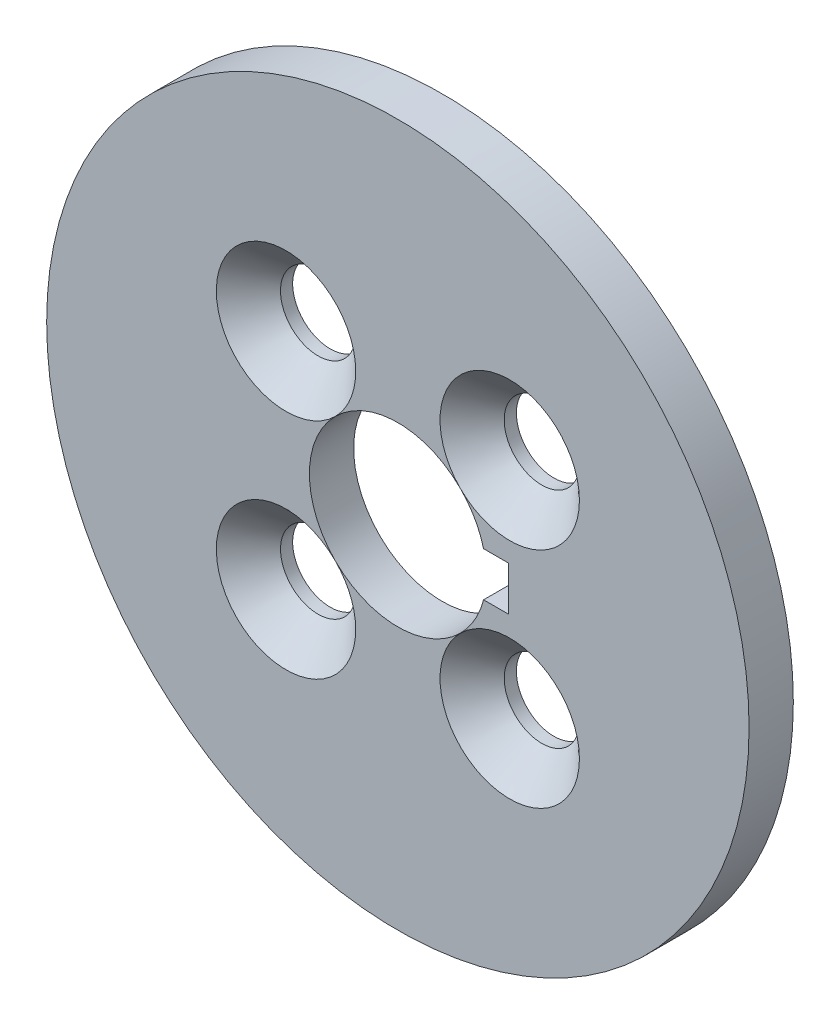
ISO-10303-21;
HEADER;
FILE_DESCRIPTION(('STEP AP214'),'2;1');
FILE_NAME('part.step','',(''),(''),'','','');
FILE_SCHEMA(('AUTOMOTIVE_DESIGN { 1 0 10303 214 1 1 1 1 }'));
ENDSEC;
DATA;
#1=APPLICATION_CONTEXT('core data for automotive mechanical design processes');
#2=APPLICATION_PROTOCOL_DEFINITION('international standard','automotive_design',2000,#1);
#3=PRODUCT_CONTEXT('',#1,'mechanical');
#4=PRODUCT('Part','Part','',(#3));
#5=PRODUCT_RELATED_PRODUCT_CATEGORY('part','',(#4));
#6=PRODUCT_DEFINITION_FORMATION('','',#4);
#7=PRODUCT_DEFINITION_CONTEXT('part definition',#1,'design');
#8=PRODUCT_DEFINITION('design','',#6,#7);
#9=PRODUCT_DEFINITION_SHAPE('','',#8);
#10=(LENGTH_UNIT() NAMED_UNIT(*) SI_UNIT(.MILLI.,.METRE.));
#11=(NAMED_UNIT(*) PLANE_ANGLE_UNIT() SI_UNIT($,.RADIAN.));
#12=(NAMED_UNIT(*) SI_UNIT($,.STERADIAN.) SOLID_ANGLE_UNIT());
#13=UNCERTAINTY_MEASURE_WITH_UNIT(LENGTH_MEASURE(1.E-05),#10,'distance_accuracy_value','');
#14=(GEOMETRIC_REPRESENTATION_CONTEXT(3) GLOBAL_UNCERTAINTY_ASSIGNED_CONTEXT((#13)) GLOBAL_UNIT_ASSIGNED_CONTEXT((#10,
#11,#12)) REPRESENTATION_CONTEXT('',''));
#15=CARTESIAN_POINT('',(0.,0.,0.));
#16=DIRECTION('',(0.,0.,1.));
#17=DIRECTION('',(1.,0.,0.));
#18=AXIS2_PLACEMENT_3D('',#15,#16,#17);
#19=CARTESIAN_POINT('',(-165.662570111801,103.941444968287,2.));
#20=DIRECTION('',(0.,0.,-1.));
#21=DIRECTION('',(-1.,0.,0.));
#22=AXIS2_PLACEMENT_3D('',#19,#20,#21);
#23=CYLINDRICAL_SURFACE('',#22,1.70000000000001);
#24=CARTESIAN_POINT('',(-165.662570111801,103.941444968287,0.));
#25=DIRECTION('',(0.,0.,1.));
#26=DIRECTION('',(1.,0.,0.));
#27=AXIS2_PLACEMENT_3D('',#24,#25,#26);
#28=CIRCLE('',#27,1.70000000000001);
#29=CARTESIAN_POINT('',(-163.962570111801,103.941444968287,0.));
#30=VERTEX_POINT('',#29);
#31=EDGE_CURVE('E157',#30,#30,#28,.T.);
#32=ORIENTED_EDGE('',*,*,#31,.F.);
#33=EDGE_LOOP('',(#32));
#34=FACE_BOUND('',#33,.T.);
#35=CARTESIAN_POINT('',(-165.662570111801,103.941444968287,0.549999999999993));
#36=DIRECTION('',(0.,0.,1.));
#37=DIRECTION('',(1.,0.,0.));
#38=AXIS2_PLACEMENT_3D('',#35,#36,#37);
#39=CIRCLE('',#38,1.69999999999998);
#40=CARTESIAN_POINT('',(-163.962570111801,103.941444968287,0.549999999999993));
#41=VERTEX_POINT('',#40);
#42=EDGE_CURVE('E119',#41,#41,#39,.T.);
#43=ORIENTED_EDGE('',*,*,#42,.T.);
#44=EDGE_LOOP('',(#43));
#45=FACE_BOUND('',#44,.T.);
#46=ADVANCED_FACE('F37',(#34,#45),#23,.F.);
#47=CARTESIAN_POINT('',(-155.550943140833,103.941444968288,2.));
#48=DIRECTION('',(0.,0.,-1.));
#49=DIRECTION('',(-1.,0.,0.));
#50=AXIS2_PLACEMENT_3D('',#47,#48,#49);
#51=CYLINDRICAL_SURFACE('',#50,1.70000000000001);
#52=CARTESIAN_POINT('',(-155.550943140833,103.941444968288,0.));
#53=DIRECTION('',(0.,0.,1.));
#54=DIRECTION('',(1.,0.,0.));
#55=AXIS2_PLACEMENT_3D('',#52,#53,#54);
#56=CIRCLE('',#55,1.70000000000001);
#57=CARTESIAN_POINT('',(-153.850943140833,103.941444968288,0.));
#58=VERTEX_POINT('',#57);
#59=EDGE_CURVE('E149',#58,#58,#56,.T.);
#60=ORIENTED_EDGE('',*,*,#59,.F.);
#61=EDGE_LOOP('',(#60));
#62=FACE_BOUND('',#61,.T.);
#63=CARTESIAN_POINT('',(-155.550943140833,103.941444968288,0.549999999999993));
#64=DIRECTION('',(0.,0.,1.));
#65=DIRECTION('',(1.,0.,0.));
#66=AXIS2_PLACEMENT_3D('',#63,#64,#65);
#67=CIRCLE('',#66,1.69999999999998);
#68=CARTESIAN_POINT('',(-153.850943140833,103.941444968288,0.549999999999993));
#69=VERTEX_POINT('',#68);
#70=EDGE_CURVE('E125',#69,#69,#67,.T.);
#71=ORIENTED_EDGE('',*,*,#70,.T.);
#72=EDGE_LOOP('',(#71));
#73=FACE_BOUND('',#72,.T.);
#74=ADVANCED_FACE('F221',(#62,#73),#51,.F.);
#75=CARTESIAN_POINT('',(-155.550943140833,93.82981799732,2.));
#76=DIRECTION('',(0.,0.,-1.));
#77=DIRECTION('',(-1.,0.,0.));
#78=AXIS2_PLACEMENT_3D('',#75,#76,#77);
#79=CYLINDRICAL_SURFACE('',#78,1.70000000000001);
#80=CARTESIAN_POINT('',(-155.550943140833,93.82981799732,0.));
#81=DIRECTION('',(0.,0.,1.));
#82=DIRECTION('',(1.,0.,0.));
#83=AXIS2_PLACEMENT_3D('',#80,#81,#82);
#84=CIRCLE('',#83,1.70000000000001);
#85=CARTESIAN_POINT('',(-153.850943140833,93.82981799732,0.));
#86=VERTEX_POINT('',#85);
#87=EDGE_CURVE('E142',#86,#86,#84,.T.);
#88=ORIENTED_EDGE('',*,*,#87,.F.);
#89=EDGE_LOOP('',(#88));
#90=FACE_BOUND('',#89,.T.);
#91=CARTESIAN_POINT('',(-155.550943140833,93.82981799732,0.549999999999993));
#92=DIRECTION('',(0.,0.,1.));
#93=DIRECTION('',(1.,0.,0.));
#94=AXIS2_PLACEMENT_3D('',#91,#92,#93);
#95=CIRCLE('',#94,1.69999999999998);
#96=CARTESIAN_POINT('',(-153.850943140833,93.82981799732,0.549999999999993));
#97=VERTEX_POINT('',#96);
#98=EDGE_CURVE('E130',#97,#97,#95,.T.);
#99=ORIENTED_EDGE('',*,*,#98,.T.);
#100=EDGE_LOOP('',(#99));
#101=FACE_BOUND('',#100,.T.);
#102=ADVANCED_FACE('F184',(#90,#101),#79,.F.);
#103=CARTESIAN_POINT('',(-165.6625701118,93.8298179973198,2.));
#104=DIRECTION('',(0.,0.,-1.));
#105=DIRECTION('',(-1.,0.,0.));
#106=AXIS2_PLACEMENT_3D('',#103,#104,#105);
#107=CYLINDRICAL_SURFACE('',#106,1.70000000000001);
#108=CARTESIAN_POINT('',(-165.6625701118,93.8298179973198,0.));
#109=DIRECTION('',(0.,0.,1.));
#110=DIRECTION('',(1.,0.,0.));
#111=AXIS2_PLACEMENT_3D('',#108,#109,#110);
#112=CIRCLE('',#111,1.70000000000001);
#113=CARTESIAN_POINT('',(-163.9625701118,93.8298179973198,0.));
#114=VERTEX_POINT('',#113);
#115=EDGE_CURVE('E139',#114,#114,#112,.T.);
#116=ORIENTED_EDGE('',*,*,#115,.F.);
#117=EDGE_LOOP('',(#116));
#118=FACE_BOUND('',#117,.T.);
#119=CARTESIAN_POINT('',(-165.6625701118,93.8298179973198,0.549999999999993));
#120=DIRECTION('',(0.,0.,1.));
#121=DIRECTION('',(1.,0.,0.));
#122=AXIS2_PLACEMENT_3D('',#119,#120,#121);
#123=CIRCLE('',#122,1.69999999999998);
#124=CARTESIAN_POINT('',(-163.9625701118,93.8298179973198,0.549999999999993));
#125=VERTEX_POINT('',#124);
#126=EDGE_CURVE('E136',#125,#125,#123,.T.);
#127=ORIENTED_EDGE('',*,*,#126,.T.);
#128=EDGE_LOOP('',(#127));
#129=FACE_BOUND('',#128,.T.);
#130=ADVANCED_FACE('F181',(#118,#129),#107,.F.);
#131=CARTESIAN_POINT('',(-160.606756626317,98.8856314828036,2.));
#132=DIRECTION('',(0.,0.,1.));
#133=DIRECTION('',(1.,0.,0.));
#134=AXIS2_PLACEMENT_3D('',#131,#132,#133);
#135=PLANE('',#134);
#136=DIRECTION('',(1.,0.,0.));
#137=VECTOR('',#136,1.);
#138=CARTESIAN_POINT('',(-155.606756626313,99.8856314828065,2.));
#139=LINE('',#138,#137);
#140=CARTESIAN_POINT('',(-156.73377328011,99.8856314828065,2.));
#141=VERTEX_POINT('',#140);
#142=CARTESIAN_POINT('',(-155.606756626313,99.8856314828065,2.));
#143=VERTEX_POINT('',#142);
#144=EDGE_CURVE('E98',#141,#143,#139,.T.);
#145=ORIENTED_EDGE('',*,*,#144,.T.);
#146=DIRECTION('',(1.94289029309404E-13,-1.,0.));
#147=VECTOR('',#146,1.);
#148=CARTESIAN_POINT('',(-155.606756626313,99.8856314828065,2.));
#149=LINE('',#148,#147);
#150=CARTESIAN_POINT('',(-155.606756626313,97.8856314828065,2.));
#151=VERTEX_POINT('',#150);
#152=EDGE_CURVE('E93',#143,#151,#149,.T.);
#153=ORIENTED_EDGE('',*,*,#152,.T.);
#154=DIRECTION('',(-1.,0.,0.));
#155=VECTOR('',#154,1.);
#156=CARTESIAN_POINT('',(-155.606756626313,97.8856314828065,2.));
#157=LINE('',#156,#155);
#158=CARTESIAN_POINT('',(-156.733773280109,97.8856314828065,2.));
#159=VERTEX_POINT('',#158);
#160=EDGE_CURVE('E101',#151,#159,#157,.T.);
#161=ORIENTED_EDGE('',*,*,#160,.T.);
#162=CARTESIAN_POINT('',(-160.606756626317,98.8856314828036,2.));
#163=DIRECTION('',(0.,0.,1.));
#164=DIRECTION('',(1.,0.,0.));
#165=AXIS2_PLACEMENT_3D('',#162,#163,#164);
#166=CIRCLE('',#165,3.99999999999999);
#167=CARTESIAN_POINT('',(-157.778329501571,96.0572043580566,2.));
#168=VERTEX_POINT('',#167);
#169=EDGE_CURVE('E150',#168,#159,#166,.T.);
#170=ORIENTED_EDGE('',*,*,#169,.F.);
#171=CARTESIAN_POINT('',(-155.550943140833,93.82981799732,2.));
#172=DIRECTION('',(0.,0.,1.));
#173=DIRECTION('',(1.,0.,0.));
#174=AXIS2_PLACEMENT_3D('',#171,#172,#173);
#175=CIRCLE('',#174,3.15000000000001);
#176=EDGE_CURVE('E128',#168,#168,#175,.T.);
#177=ORIENTED_EDGE('',*,*,#176,.F.);
#178=CARTESIAN_POINT('',(-163.435183751064,96.0572043580586,2.));
#179=VERTEX_POINT('',#178);
#180=EDGE_CURVE('E146',#179,#168,#166,.T.);
#181=ORIENTED_EDGE('',*,*,#180,.F.);
#182=CARTESIAN_POINT('',(-165.6625701118,93.8298179973198,2.));
#183=DIRECTION('',(0.,0.,1.));
#184=DIRECTION('',(1.,0.,0.));
#185=AXIS2_PLACEMENT_3D('',#182,#183,#184);
#186=CIRCLE('',#185,3.14999999999999);
#187=EDGE_CURVE('E133',#179,#179,#186,.T.);
#188=ORIENTED_EDGE('',*,*,#187,.F.);
#189=CARTESIAN_POINT('',(-163.435183751065,101.714058607548,2.));
#190=VERTEX_POINT('',#189);
#191=EDGE_CURVE('E154',#190,#179,#166,.T.);
#192=ORIENTED_EDGE('',*,*,#191,.F.);
#193=CARTESIAN_POINT('',(-165.662570111801,103.941444968287,2.));
#194=DIRECTION('',(0.,0.,1.));
#195=DIRECTION('',(1.,0.,0.));
#196=AXIS2_PLACEMENT_3D('',#193,#194,#195);
#197=CIRCLE('',#196,3.15000000000001);
#198=EDGE_CURVE('E58',#190,#190,#197,.T.);
#199=ORIENTED_EDGE('',*,*,#198,.F.);
#200=CARTESIAN_POINT('',(-157.77832950157,101.714058607549,2.));
#201=VERTEX_POINT('',#200);
#202=EDGE_CURVE('E202',#201,#190,#166,.T.);
#203=ORIENTED_EDGE('',*,*,#202,.F.);
#204=CARTESIAN_POINT('',(-155.550943140833,103.941444968288,2.));
#205=DIRECTION('',(0.,0.,1.));
#206=DIRECTION('',(1.,0.,0.));
#207=AXIS2_PLACEMENT_3D('',#204,#205,#206);
#208=CIRCLE('',#207,3.15000000000001);
#209=EDGE_CURVE('E122',#201,#201,#208,.T.);
#210=ORIENTED_EDGE('',*,*,#209,.F.);
#211=EDGE_CURVE('E151',#141,#201,#166,.T.);
#212=ORIENTED_EDGE('',*,*,#211,.F.);
#213=EDGE_LOOP('',(#145,#153,#161,#170,#177,#181,#188,#192,#199,#203,#210,#212));
#214=FACE_BOUND('',#213,.T.);
#215=CARTESIAN_POINT('',(-160.606756626317,98.8856314828036,2.));
#216=DIRECTION('',(0.,0.,1.));
#217=DIRECTION('',(1.,0.,0.));
#218=AXIS2_PLACEMENT_3D('',#215,#216,#217);
#219=CIRCLE('',#218,15.875);
#220=CARTESIAN_POINT('',(-144.731756626317,98.8856314828036,2.));
#221=VERTEX_POINT('',#220);
#222=EDGE_CURVE('E161',#221,#221,#219,.T.);
#223=ORIENTED_EDGE('',*,*,#222,.T.);
#224=EDGE_LOOP('',(#223));
#225=FACE_BOUND('',#224,.T.);
#226=ADVANCED_FACE('F107',(#214,#225),#135,.T.);
#227=CARTESIAN_POINT('',(-160.606756626317,98.8856314828036,0.));
#228=DIRECTION('',(0.,0.,1.));
#229=DIRECTION('',(1.,0.,0.));
#230=AXIS2_PLACEMENT_3D('',#227,#228,#229);
#231=PLANE('',#230);
#232=CARTESIAN_POINT('',(-160.606756626317,98.8856314828036,0.));
#233=DIRECTION('',(0.,0.,1.));
#234=DIRECTION('',(1.,0.,0.));
#235=AXIS2_PLACEMENT_3D('',#232,#233,#234);
#236=CIRCLE('',#235,15.875);
#237=CARTESIAN_POINT('',(-144.731756626317,98.8856314828036,0.));
#238=VERTEX_POINT('',#237);
#239=EDGE_CURVE('E160',#238,#238,#236,.T.);
#240=ORIENTED_EDGE('',*,*,#239,.F.);
#241=EDGE_LOOP('',(#240));
#242=FACE_BOUND('',#241,.T.);
#243=ORIENTED_EDGE('',*,*,#31,.T.);
#244=EDGE_LOOP('',(#243));
#245=FACE_BOUND('',#244,.T.);
#246=ORIENTED_EDGE('',*,*,#59,.T.);
#247=EDGE_LOOP('',(#246));
#248=FACE_BOUND('',#247,.T.);
#249=DIRECTION('',(1.94289029309404E-13,-1.,0.));
#250=VECTOR('',#249,1.);
#251=CARTESIAN_POINT('',(-155.606756626313,99.8856314828065,0.));
#252=LINE('',#251,#250);
#253=CARTESIAN_POINT('',(-155.606756626313,99.8856314828065,0.));
#254=VERTEX_POINT('',#253);
#255=CARTESIAN_POINT('',(-155.606756626313,97.8856314828065,0.));
#256=VERTEX_POINT('',#255);
#257=EDGE_CURVE('E96',#254,#256,#252,.T.);
#258=ORIENTED_EDGE('',*,*,#257,.F.);
#259=DIRECTION('',(1.,0.,0.));
#260=VECTOR('',#259,1.);
#261=CARTESIAN_POINT('',(-155.606756626313,99.8856314828065,0.));
#262=LINE('',#261,#260);
#263=CARTESIAN_POINT('',(-156.73377328011,99.8856314828065,0.));
#264=VERTEX_POINT('',#263);
#265=EDGE_CURVE('E110',#264,#254,#262,.T.);
#266=ORIENTED_EDGE('',*,*,#265,.F.);
#267=CARTESIAN_POINT('',(-160.606756626317,98.8856314828036,0.));
#268=DIRECTION('',(0.,0.,1.));
#269=DIRECTION('',(1.,0.,0.));
#270=AXIS2_PLACEMENT_3D('',#267,#268,#269);
#271=CIRCLE('',#270,3.99999999999999);
#272=CARTESIAN_POINT('',(-156.733773280109,97.8856314828065,0.));
#273=VERTEX_POINT('',#272);
#274=EDGE_CURVE('E145',#264,#273,#271,.T.);
#275=ORIENTED_EDGE('',*,*,#274,.T.);
#276=DIRECTION('',(-1.,0.,0.));
#277=VECTOR('',#276,1.);
#278=CARTESIAN_POINT('',(-155.606756626313,97.8856314828065,0.));
#279=LINE('',#278,#277);
#280=EDGE_CURVE('E52',#256,#273,#279,.T.);
#281=ORIENTED_EDGE('',*,*,#280,.F.);
#282=EDGE_LOOP('',(#258,#266,#275,#281));
#283=FACE_BOUND('',#282,.T.);
#284=ORIENTED_EDGE('',*,*,#87,.T.);
#285=EDGE_LOOP('',(#284));
#286=FACE_BOUND('',#285,.T.);
#287=ORIENTED_EDGE('',*,*,#115,.T.);
#288=EDGE_LOOP('',(#287));
#289=FACE_BOUND('',#288,.T.);
#290=ADVANCED_FACE('F168',(#242,#245,#248,#283,#286,#289),#231,.F.);
#291=CARTESIAN_POINT('',(-160.606756626317,98.8856314828036,2.));
#292=DIRECTION('',(0.,0.,-1.));
#293=DIRECTION('',(-1.,0.,0.));
#294=AXIS2_PLACEMENT_3D('',#291,#292,#293);
#295=CYLINDRICAL_SURFACE('',#294,15.875);
#296=ORIENTED_EDGE('',*,*,#222,.F.);
#297=EDGE_LOOP('',(#296));
#298=FACE_BOUND('',#297,.T.);
#299=ORIENTED_EDGE('',*,*,#239,.T.);
#300=EDGE_LOOP('',(#299));
#301=FACE_BOUND('',#300,.T.);
#302=ADVANCED_FACE('F39',(#298,#301),#295,.T.);
#303=CARTESIAN_POINT('',(-160.606756626317,98.8856314828036,2.));
#304=DIRECTION('',(0.,0.,-1.));
#305=DIRECTION('',(-1.,0.,0.));
#306=AXIS2_PLACEMENT_3D('',#303,#304,#305);
#307=CYLINDRICAL_SURFACE('',#306,3.99999999999999);
#308=DIRECTION('',(0.,0.,-1.));
#309=VECTOR('',#308,1.);
#310=CARTESIAN_POINT('',(-156.73377328011,99.8856314828065,2.));
#311=LINE('',#310,#309);
#312=EDGE_CURVE('E11',#141,#264,#311,.T.);
#313=ORIENTED_EDGE('',*,*,#312,.F.);
#314=ORIENTED_EDGE('',*,*,#211,.T.);
#315=ORIENTED_EDGE('',*,*,#202,.T.);
#316=ORIENTED_EDGE('',*,*,#191,.T.);
#317=ORIENTED_EDGE('',*,*,#180,.T.);
#318=ORIENTED_EDGE('',*,*,#169,.T.);
#319=DIRECTION('',(0.,0.,-1.));
#320=VECTOR('',#319,1.);
#321=CARTESIAN_POINT('',(-156.733773280109,97.8856314828065,2.));
#322=LINE('',#321,#320);
#323=EDGE_CURVE('E45',#273,#159,#322,.F.);
#324=ORIENTED_EDGE('',*,*,#323,.F.);
#325=ORIENTED_EDGE('',*,*,#274,.F.);
#326=EDGE_LOOP('',(#313,#314,#315,#316,#317,#318,#324,#325));
#327=FACE_BOUND('',#326,.T.);
#328=ADVANCED_FACE('F192',(#327),#307,.F.);
#329=CARTESIAN_POINT('',(-165.6625701118,93.8298179973198,2.));
#330=DIRECTION('',(0.,0.,1.));
#331=DIRECTION('',(1.,0.,0.));
#332=AXIS2_PLACEMENT_3D('',#329,#330,#331);
#333=CONICAL_SURFACE('',#332,3.14999999999999,0.785398163397448);
#334=ORIENTED_EDGE('',*,*,#126,.F.);
#335=EDGE_LOOP('',(#334));
#336=FACE_BOUND('',#335,.T.);
#337=ORIENTED_EDGE('',*,*,#187,.T.);
#338=EDGE_LOOP('',(#337));
#339=FACE_BOUND('',#338,.T.);
#340=ADVANCED_FACE('F188',(#336,#339),#333,.F.);
#341=CARTESIAN_POINT('',(-155.550943140833,93.82981799732,2.));
#342=DIRECTION('',(0.,0.,1.));
#343=DIRECTION('',(1.,0.,0.));
#344=AXIS2_PLACEMENT_3D('',#341,#342,#343);
#345=CONICAL_SURFACE('',#344,3.15000000000001,0.785398163397457);
#346=ORIENTED_EDGE('',*,*,#98,.F.);
#347=EDGE_LOOP('',(#346));
#348=FACE_BOUND('',#347,.T.);
#349=ORIENTED_EDGE('',*,*,#176,.T.);
#350=EDGE_LOOP('',(#349));
#351=FACE_BOUND('',#350,.T.);
#352=ADVANCED_FACE('F191',(#348,#351),#345,.F.);
#353=CARTESIAN_POINT('',(-155.550943140833,103.941444968288,2.));
#354=DIRECTION('',(0.,0.,1.));
#355=DIRECTION('',(1.,0.,0.));
#356=AXIS2_PLACEMENT_3D('',#353,#354,#355);
#357=CONICAL_SURFACE('',#356,3.15000000000001,0.785398163397457);
#358=ORIENTED_EDGE('',*,*,#70,.F.);
#359=EDGE_LOOP('',(#358));
#360=FACE_BOUND('',#359,.T.);
#361=ORIENTED_EDGE('',*,*,#209,.T.);
#362=EDGE_LOOP('',(#361));
#363=FACE_BOUND('',#362,.T.);
#364=ADVANCED_FACE('F206',(#360,#363),#357,.F.);
#365=CARTESIAN_POINT('',(-165.662570111801,103.941444968287,2.));
#366=DIRECTION('',(0.,0.,1.));
#367=DIRECTION('',(1.,0.,0.));
#368=AXIS2_PLACEMENT_3D('',#365,#366,#367);
#369=CONICAL_SURFACE('',#368,3.15000000000001,0.785398163397457);
#370=ORIENTED_EDGE('',*,*,#42,.F.);
#371=EDGE_LOOP('',(#370));
#372=FACE_BOUND('',#371,.T.);
#373=ORIENTED_EDGE('',*,*,#198,.T.);
#374=EDGE_LOOP('',(#373));
#375=FACE_BOUND('',#374,.T.);
#376=ADVANCED_FACE('F208',(#372,#375),#369,.F.);
#377=CARTESIAN_POINT('',(-155.606756626313,99.8856314828065,2.));
#378=DIRECTION('',(1.,1.94289029309404E-13,0.));
#379=DIRECTION('',(-1.94289029309404E-13,1.,0.));
#380=AXIS2_PLACEMENT_3D('',#377,#378,#379);
#381=PLANE('',#380);
#382=ORIENTED_EDGE('',*,*,#257,.T.);
#383=DIRECTION('',(0.,0.,-1.));
#384=VECTOR('',#383,1.);
#385=CARTESIAN_POINT('',(-155.606756626313,97.8856314828065,2.));
#386=LINE('',#385,#384);
#387=EDGE_CURVE('E88',#151,#256,#386,.T.);
#388=ORIENTED_EDGE('',*,*,#387,.F.);
#389=ORIENTED_EDGE('',*,*,#152,.F.);
#390=DIRECTION('',(0.,0.,-1.));
#391=VECTOR('',#390,1.);
#392=CARTESIAN_POINT('',(-155.606756626313,99.8856314828065,2.));
#393=LINE('',#392,#391);
#394=EDGE_CURVE('E97',#143,#254,#393,.T.);
#395=ORIENTED_EDGE('',*,*,#394,.T.);
#396=EDGE_LOOP('',(#382,#388,#389,#395));
#397=FACE_BOUND('',#396,.T.);
#398=ADVANCED_FACE('F90',(#397),#381,.F.);
#399=CARTESIAN_POINT('',(-155.606756626313,99.8856314828065,2.));
#400=DIRECTION('',(0.,1.,0.));
#401=DIRECTION('',(0.,0.,1.));
#402=AXIS2_PLACEMENT_3D('',#399,#400,#401);
#403=PLANE('',#402);
#404=ORIENTED_EDGE('',*,*,#312,.T.);
#405=ORIENTED_EDGE('',*,*,#265,.T.);
#406=ORIENTED_EDGE('',*,*,#394,.F.);
#407=ORIENTED_EDGE('',*,*,#144,.F.);
#408=EDGE_LOOP('',(#404,#405,#406,#407));
#409=FACE_BOUND('',#408,.T.);
#410=ADVANCED_FACE('F280',(#409),#403,.F.);
#411=CARTESIAN_POINT('',(-155.606756626313,97.8856314828065,2.));
#412=DIRECTION('',(0.,-1.,0.));
#413=DIRECTION('',(0.,0.,-1.));
#414=AXIS2_PLACEMENT_3D('',#411,#412,#413);
#415=PLANE('',#414);
#416=ORIENTED_EDGE('',*,*,#323,.T.);
#417=ORIENTED_EDGE('',*,*,#160,.F.);
#418=ORIENTED_EDGE('',*,*,#387,.T.);
#419=ORIENTED_EDGE('',*,*,#280,.T.);
#420=EDGE_LOOP('',(#416,#417,#418,#419));
#421=FACE_BOUND('',#420,.T.);
#422=ADVANCED_FACE('F102',(#421),#415,.F.);
#423=CLOSED_SHELL('',(#46,#74,#102,#130,#226,#290,#302,#328,#340,#352,#364,#376,#398,#410,#422));
#424=MANIFOLD_SOLID_BREP('B2',#423);
#425=ADVANCED_BREP_SHAPE_REPRESENTATION('',(#18,#424),#14);
#426=SHAPE_DEFINITION_REPRESENTATION(#9,#425);
ENDSEC;
END-ISO-10303-21;
